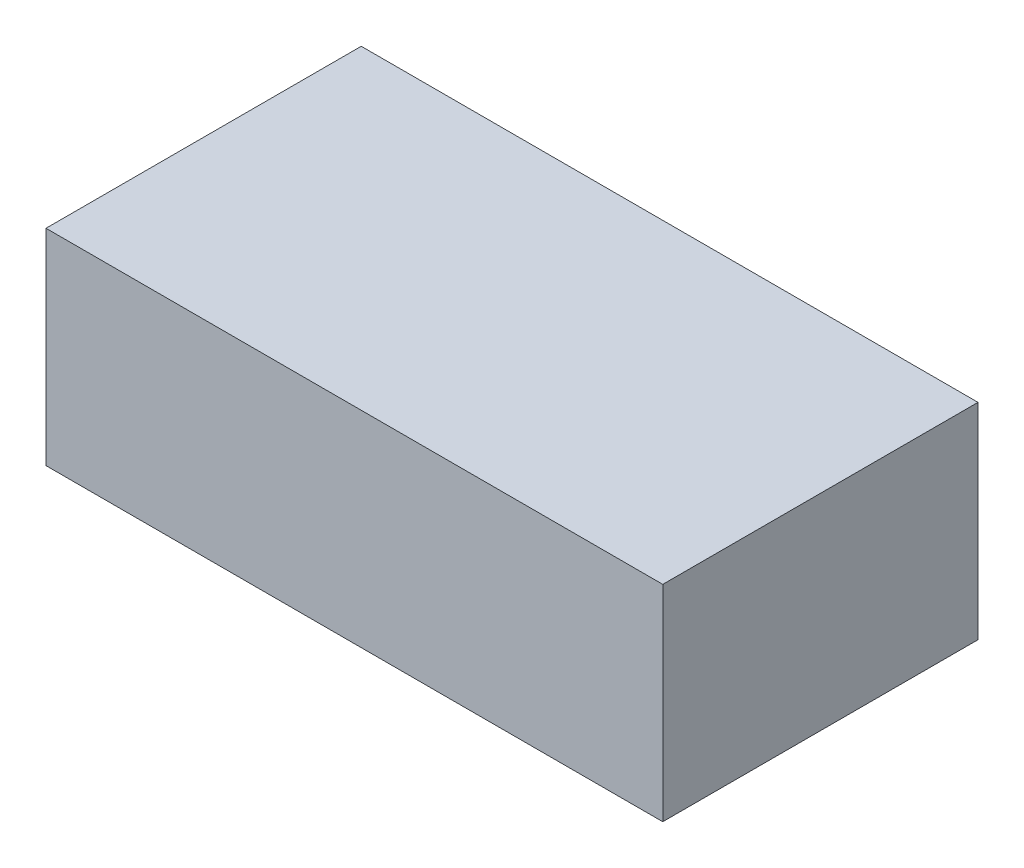
ISO-10303-21;
HEADER;
FILE_DESCRIPTION(('STEP AP214'),'2;1');
FILE_NAME('part.step','',(''),(''),'','','');
FILE_SCHEMA(('AUTOMOTIVE_DESIGN { 1 0 10303 214 1 1 1 1 }'));
ENDSEC;
DATA;
#1=APPLICATION_CONTEXT('core data for automotive mechanical design processes');
#2=APPLICATION_PROTOCOL_DEFINITION('international standard','automotive_design',2000,#1);
#3=PRODUCT_CONTEXT('',#1,'mechanical');
#4=PRODUCT('Part','Part','',(#3));
#5=PRODUCT_RELATED_PRODUCT_CATEGORY('part','',(#4));
#6=PRODUCT_DEFINITION_FORMATION('','',#4);
#7=PRODUCT_DEFINITION_CONTEXT('part definition',#1,'design');
#8=PRODUCT_DEFINITION('design','',#6,#7);
#9=PRODUCT_DEFINITION_SHAPE('','',#8);
#10=(LENGTH_UNIT() NAMED_UNIT(*) SI_UNIT(.MILLI.,.METRE.));
#11=(NAMED_UNIT(*) PLANE_ANGLE_UNIT() SI_UNIT($,.RADIAN.));
#12=(NAMED_UNIT(*) SI_UNIT($,.STERADIAN.) SOLID_ANGLE_UNIT());
#13=UNCERTAINTY_MEASURE_WITH_UNIT(LENGTH_MEASURE(1.E-05),#10,'distance_accuracy_value','');
#14=(GEOMETRIC_REPRESENTATION_CONTEXT(3) GLOBAL_UNCERTAINTY_ASSIGNED_CONTEXT((#13)) GLOBAL_UNIT_ASSIGNED_CONTEXT((#10,
#11,#12)) REPRESENTATION_CONTEXT('',''));
#15=CARTESIAN_POINT('',(0.,0.,0.));
#16=DIRECTION('',(0.,0.,1.));
#17=DIRECTION('',(1.,0.,0.));
#18=AXIS2_PLACEMENT_3D('',#15,#16,#17);
#19=CARTESIAN_POINT('',(0.45000164,-0.1499997,0.));
#20=DIRECTION('',(0.,-1.,0.));
#21=DIRECTION('',(0.,0.,-1.));
#22=AXIS2_PLACEMENT_3D('',#19,#20,#21);
#23=PLANE('',#22);
#24=DIRECTION('',(0.,0.,1.));
#25=VECTOR('',#24,1.);
#26=CARTESIAN_POINT('',(-0.45000164,-0.1499997,0.));
#27=LINE('',#26,#25);
#28=CARTESIAN_POINT('',(-0.45000164,-0.1499997,0.));
#29=VERTEX_POINT('',#28);
#30=CARTESIAN_POINT('',(-0.45000164,-0.1499997,0.45999908));
#31=VERTEX_POINT('',#30);
#32=EDGE_CURVE('E19',#29,#31,#27,.T.);
#33=ORIENTED_EDGE('',*,*,#32,.F.);
#34=DIRECTION('',(1.,0.,0.));
#35=VECTOR('',#34,1.);
#36=CARTESIAN_POINT('',(-0.45000164,-0.1499997,0.));
#37=LINE('',#36,#35);
#38=CARTESIAN_POINT('',(0.45000164,-0.1499997,0.));
#39=VERTEX_POINT('',#38);
#40=EDGE_CURVE('E79',#29,#39,#37,.T.);
#41=ORIENTED_EDGE('',*,*,#40,.T.);
#42=DIRECTION('',(0.,0.,-1.));
#43=VECTOR('',#42,1.);
#44=CARTESIAN_POINT('',(0.45000164,-0.1499997,0.));
#45=LINE('',#44,#43);
#46=CARTESIAN_POINT('',(0.45000164,-0.1499997,0.45999908));
#47=VERTEX_POINT('',#46);
#48=EDGE_CURVE('E67',#47,#39,#45,.T.);
#49=ORIENTED_EDGE('',*,*,#48,.F.);
#50=DIRECTION('',(1.,0.,0.));
#51=VECTOR('',#50,1.);
#52=CARTESIAN_POINT('',(-0.45000164,-0.1499997,0.45999908));
#53=LINE('',#52,#51);
#54=EDGE_CURVE('E55',#31,#47,#53,.T.);
#55=ORIENTED_EDGE('',*,*,#54,.F.);
#56=EDGE_LOOP('',(#33,#41,#49,#55));
#57=FACE_BOUND('',#56,.T.);
#58=ADVANCED_FACE('F16',(#57),#23,.T.);
#59=CARTESIAN_POINT('',(-0.45000164,-0.1499997,0.));
#60=DIRECTION('',(-1.,0.,0.));
#61=DIRECTION('',(0.,0.,1.));
#62=AXIS2_PLACEMENT_3D('',#59,#60,#61);
#63=PLANE('',#62);
#64=DIRECTION('',(0.,0.,1.));
#65=VECTOR('',#64,1.);
#66=CARTESIAN_POINT('',(-0.45000164,0.15000224,0.));
#67=LINE('',#66,#65);
#68=CARTESIAN_POINT('',(-0.45000164,0.15000224,0.));
#69=VERTEX_POINT('',#68);
#70=CARTESIAN_POINT('',(-0.45000164,0.15000224,0.45999908));
#71=VERTEX_POINT('',#70);
#72=EDGE_CURVE('E82',#69,#71,#67,.T.);
#73=ORIENTED_EDGE('',*,*,#72,.F.);
#74=DIRECTION('',(0.,1.,0.));
#75=VECTOR('',#74,1.);
#76=CARTESIAN_POINT('',(-0.45000164,0.15000224,0.));
#77=LINE('',#76,#75);
#78=EDGE_CURVE('E64',#69,#29,#77,.F.);
#79=ORIENTED_EDGE('',*,*,#78,.T.);
#80=ORIENTED_EDGE('',*,*,#32,.T.);
#81=DIRECTION('',(0.,1.,0.));
#82=VECTOR('',#81,1.);
#83=CARTESIAN_POINT('',(-0.45000164,0.15000224,0.45999908));
#84=LINE('',#83,#82);
#85=EDGE_CURVE('E61',#71,#31,#84,.F.);
#86=ORIENTED_EDGE('',*,*,#85,.F.);
#87=EDGE_LOOP('',(#73,#79,#80,#86));
#88=FACE_BOUND('',#87,.T.);
#89=ADVANCED_FACE('F60',(#88),#63,.T.);
#90=CARTESIAN_POINT('',(-0.45000164,0.15000224,0.45999908));
#91=DIRECTION('',(0.,0.,1.));
#92=DIRECTION('',(1.,0.,0.));
#93=AXIS2_PLACEMENT_3D('',#90,#91,#92);
#94=PLANE('',#93);
#95=DIRECTION('',(0.,1.,0.));
#96=VECTOR('',#95,1.);
#97=CARTESIAN_POINT('',(0.45000164,0.15000224,0.45999908));
#98=LINE('',#97,#96);
#99=CARTESIAN_POINT('',(0.45000164,0.15000224,0.45999908));
#100=VERTEX_POINT('',#99);
#101=EDGE_CURVE('E69',#100,#47,#98,.F.);
#102=ORIENTED_EDGE('',*,*,#101,.F.);
#103=DIRECTION('',(1.,0.,0.));
#104=VECTOR('',#103,1.);
#105=CARTESIAN_POINT('',(-0.45000164,0.15000224,0.45999908));
#106=LINE('',#105,#104);
#107=EDGE_CURVE('E73',#71,#100,#106,.T.);
#108=ORIENTED_EDGE('',*,*,#107,.F.);
#109=ORIENTED_EDGE('',*,*,#85,.T.);
#110=ORIENTED_EDGE('',*,*,#54,.T.);
#111=EDGE_LOOP('',(#102,#108,#109,#110));
#112=FACE_BOUND('',#111,.T.);
#113=ADVANCED_FACE('F71',(#112),#94,.T.);
#114=CARTESIAN_POINT('',(0.45000164,0.15000224,0.));
#115=DIRECTION('',(1.,0.,0.));
#116=DIRECTION('',(0.,0.,-1.));
#117=AXIS2_PLACEMENT_3D('',#114,#115,#116);
#118=PLANE('',#117);
#119=ORIENTED_EDGE('',*,*,#48,.T.);
#120=DIRECTION('',(0.,1.,0.));
#121=VECTOR('',#120,1.);
#122=CARTESIAN_POINT('',(0.45000164,0.15000224,0.));
#123=LINE('',#122,#121);
#124=CARTESIAN_POINT('',(0.45000164,0.15000224,0.));
#125=VERTEX_POINT('',#124);
#126=EDGE_CURVE('E34',#39,#125,#123,.T.);
#127=ORIENTED_EDGE('',*,*,#126,.T.);
#128=DIRECTION('',(0.,0.,1.));
#129=VECTOR('',#128,1.);
#130=CARTESIAN_POINT('',(0.45000164,0.15000224,0.));
#131=LINE('',#130,#129);
#132=EDGE_CURVE('E25',#100,#125,#131,.F.);
#133=ORIENTED_EDGE('',*,*,#132,.F.);
#134=ORIENTED_EDGE('',*,*,#101,.T.);
#135=EDGE_LOOP('',(#119,#127,#133,#134));
#136=FACE_BOUND('',#135,.T.);
#137=ADVANCED_FACE('F88',(#136),#118,.T.);
#138=CARTESIAN_POINT('',(-0.45000164,0.15000224,0.));
#139=DIRECTION('',(0.,0.,1.));
#140=DIRECTION('',(1.,0.,0.));
#141=AXIS2_PLACEMENT_3D('',#138,#139,#140);
#142=PLANE('',#141);
#143=ORIENTED_EDGE('',*,*,#126,.F.);
#144=ORIENTED_EDGE('',*,*,#40,.F.);
#145=ORIENTED_EDGE('',*,*,#78,.F.);
#146=DIRECTION('',(1.,0.,0.));
#147=VECTOR('',#146,1.);
#148=CARTESIAN_POINT('',(-0.45000164,0.15000224,0.));
#149=LINE('',#148,#147);
#150=EDGE_CURVE('E11',#125,#69,#149,.F.);
#151=ORIENTED_EDGE('',*,*,#150,.F.);
#152=EDGE_LOOP('',(#143,#144,#145,#151));
#153=FACE_BOUND('',#152,.T.);
#154=ADVANCED_FACE('F90',(#153),#142,.F.);
#155=CARTESIAN_POINT('',(-0.45000164,0.15000224,0.));
#156=DIRECTION('',(0.,1.,0.));
#157=DIRECTION('',(0.,0.,1.));
#158=AXIS2_PLACEMENT_3D('',#155,#156,#157);
#159=PLANE('',#158);
#160=ORIENTED_EDGE('',*,*,#132,.T.);
#161=ORIENTED_EDGE('',*,*,#150,.T.);
#162=ORIENTED_EDGE('',*,*,#72,.T.);
#163=ORIENTED_EDGE('',*,*,#107,.T.);
#164=EDGE_LOOP('',(#160,#161,#162,#163));
#165=FACE_BOUND('',#164,.T.);
#166=ADVANCED_FACE('F87',(#165),#159,.T.);
#167=CLOSED_SHELL('',(#58,#89,#113,#137,#154,#166));
#168=MANIFOLD_SOLID_BREP('B1',#167);
#169=ADVANCED_BREP_SHAPE_REPRESENTATION('',(#18,#168),#14);
#170=SHAPE_DEFINITION_REPRESENTATION(#9,#169);
ENDSEC;
END-ISO-10303-21;
